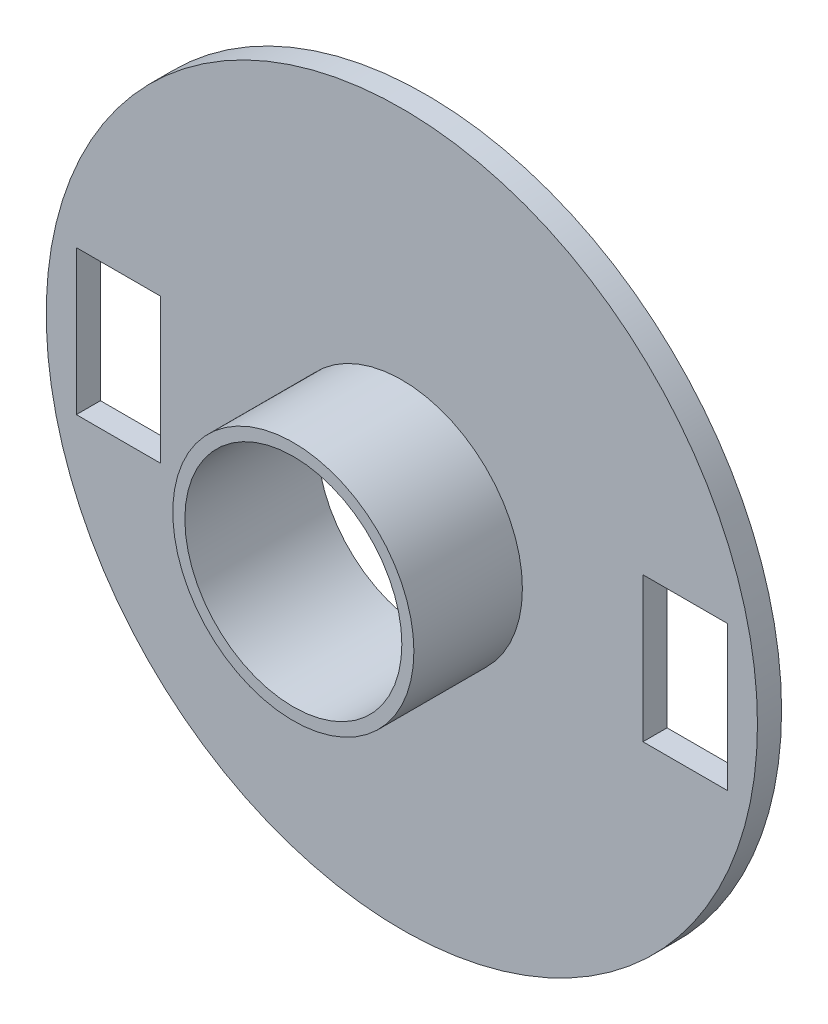
ISO-10303-21;
HEADER;
FILE_DESCRIPTION(('STEP AP214'),'2;1');
FILE_NAME('part.step','',(''),(''),'','','');
FILE_SCHEMA(('AUTOMOTIVE_DESIGN { 1 0 10303 214 1 1 1 1 }'));
ENDSEC;
DATA;
#1=APPLICATION_CONTEXT('core data for automotive mechanical design processes');
#2=APPLICATION_PROTOCOL_DEFINITION('international standard','automotive_design',2000,#1);
#3=PRODUCT_CONTEXT('',#1,'mechanical');
#4=PRODUCT('Part','Part','',(#3));
#5=PRODUCT_RELATED_PRODUCT_CATEGORY('part','',(#4));
#6=PRODUCT_DEFINITION_FORMATION('','',#4);
#7=PRODUCT_DEFINITION_CONTEXT('part definition',#1,'design');
#8=PRODUCT_DEFINITION('design','',#6,#7);
#9=PRODUCT_DEFINITION_SHAPE('','',#8);
#10=(LENGTH_UNIT() NAMED_UNIT(*) SI_UNIT(.MILLI.,.METRE.));
#11=(NAMED_UNIT(*) PLANE_ANGLE_UNIT() SI_UNIT($,.RADIAN.));
#12=(NAMED_UNIT(*) SI_UNIT($,.STERADIAN.) SOLID_ANGLE_UNIT());
#13=UNCERTAINTY_MEASURE_WITH_UNIT(LENGTH_MEASURE(1.E-05),#10,'distance_accuracy_value','');
#14=(GEOMETRIC_REPRESENTATION_CONTEXT(3) GLOBAL_UNCERTAINTY_ASSIGNED_CONTEXT((#13)) GLOBAL_UNIT_ASSIGNED_CONTEXT((#10,
#11,#12)) REPRESENTATION_CONTEXT('',''));
#15=CARTESIAN_POINT('',(0.,0.,0.));
#16=DIRECTION('',(0.,0.,1.));
#17=DIRECTION('',(1.,0.,0.));
#18=AXIS2_PLACEMENT_3D('',#15,#16,#17);
#19=CARTESIAN_POINT('',(0.,0.,1.));
#20=DIRECTION('',(0.,0.,-1.));
#21=DIRECTION('',(-1.,0.,0.));
#22=AXIS2_PLACEMENT_3D('',#19,#20,#21);
#23=CYLINDRICAL_SURFACE('',#22,14.75);
#24=CARTESIAN_POINT('',(0.,0.,1.));
#25=DIRECTION('',(0.,0.,1.));
#26=DIRECTION('',(1.,0.,0.));
#27=AXIS2_PLACEMENT_3D('',#24,#25,#26);
#28=CIRCLE('',#27,14.75);
#29=CARTESIAN_POINT('',(14.75,0.,1.));
#30=VERTEX_POINT('',#29);
#31=EDGE_CURVE('E47',#30,#30,#28,.T.);
#32=ORIENTED_EDGE('',*,*,#31,.F.);
#33=EDGE_LOOP('',(#32));
#34=FACE_BOUND('',#33,.T.);
#35=CARTESIAN_POINT('',(0.,0.,0.));
#36=DIRECTION('',(0.,0.,1.));
#37=DIRECTION('',(1.,0.,0.));
#38=AXIS2_PLACEMENT_3D('',#35,#36,#37);
#39=CIRCLE('',#38,14.75);
#40=CARTESIAN_POINT('',(14.75,0.,0.));
#41=VERTEX_POINT('',#40);
#42=EDGE_CURVE('E42',#41,#41,#39,.T.);
#43=ORIENTED_EDGE('',*,*,#42,.T.);
#44=EDGE_LOOP('',(#43));
#45=FACE_BOUND('',#44,.T.);
#46=ADVANCED_FACE('F39',(#34,#45),#23,.T.);
#47=CARTESIAN_POINT('',(0.,0.,1.));
#48=DIRECTION('',(0.,0.,1.));
#49=DIRECTION('',(1.,0.,0.));
#50=AXIS2_PLACEMENT_3D('',#47,#48,#49);
#51=PLANE('',#50);
#52=DIRECTION('',(-1.,0.,0.));
#53=VECTOR('',#52,1.);
#54=CARTESIAN_POINT('',(0.,3.,1.));
#55=LINE('',#54,#53);
#56=CARTESIAN_POINT('',(13.5,3.,1.));
#57=VERTEX_POINT('',#56);
#58=CARTESIAN_POINT('',(10.,3.,1.));
#59=VERTEX_POINT('',#58);
#60=EDGE_CURVE('E178',#57,#59,#55,.T.);
#61=ORIENTED_EDGE('',*,*,#60,.F.);
#62=DIRECTION('',(0.,1.,0.));
#63=VECTOR('',#62,1.);
#64=CARTESIAN_POINT('',(13.5,0.,1.));
#65=LINE('',#64,#63);
#66=CARTESIAN_POINT('',(13.5,-3.,1.));
#67=VERTEX_POINT('',#66);
#68=EDGE_CURVE('E176',#67,#57,#65,.T.);
#69=ORIENTED_EDGE('',*,*,#68,.F.);
#70=DIRECTION('',(1.,0.,0.));
#71=VECTOR('',#70,1.);
#72=CARTESIAN_POINT('',(0.,-3.00000000000001,1.));
#73=LINE('',#72,#71);
#74=CARTESIAN_POINT('',(10.,-3.,1.));
#75=VERTEX_POINT('',#74);
#76=EDGE_CURVE('E174',#75,#67,#73,.T.);
#77=ORIENTED_EDGE('',*,*,#76,.F.);
#78=DIRECTION('',(0.,-1.,0.));
#79=VECTOR('',#78,1.);
#80=CARTESIAN_POINT('',(10.,0.,1.));
#81=LINE('',#80,#79);
#82=EDGE_CURVE('E172',#59,#75,#81,.T.);
#83=ORIENTED_EDGE('',*,*,#82,.F.);
#84=EDGE_LOOP('',(#61,#69,#77,#83));
#85=FACE_BOUND('',#84,.T.);
#86=DIRECTION('',(0.,-1.,0.));
#87=VECTOR('',#86,1.);
#88=CARTESIAN_POINT('',(-13.5,0.,1.));
#89=LINE('',#88,#87);
#90=CARTESIAN_POINT('',(-13.5,2.99999999999999,1.));
#91=VERTEX_POINT('',#90);
#92=CARTESIAN_POINT('',(-13.5,-3.00000000000001,1.));
#93=VERTEX_POINT('',#92);
#94=EDGE_CURVE('E110',#91,#93,#89,.T.);
#95=ORIENTED_EDGE('',*,*,#94,.F.);
#96=DIRECTION('',(-1.,0.,0.));
#97=VECTOR('',#96,1.);
#98=CARTESIAN_POINT('',(0.,3.,1.));
#99=LINE('',#98,#97);
#100=CARTESIAN_POINT('',(-10.,3.,1.));
#101=VERTEX_POINT('',#100);
#102=EDGE_CURVE('E169',#101,#91,#99,.T.);
#103=ORIENTED_EDGE('',*,*,#102,.F.);
#104=DIRECTION('',(0.,1.,0.));
#105=VECTOR('',#104,1.);
#106=CARTESIAN_POINT('',(-10.,0.,1.));
#107=LINE('',#106,#105);
#108=CARTESIAN_POINT('',(-10.,-3.00000000000001,1.));
#109=VERTEX_POINT('',#108);
#110=EDGE_CURVE('E167',#109,#101,#107,.T.);
#111=ORIENTED_EDGE('',*,*,#110,.F.);
#112=DIRECTION('',(1.,0.,0.));
#113=VECTOR('',#112,1.);
#114=CARTESIAN_POINT('',(0.,-3.00000000000001,1.));
#115=LINE('',#114,#113);
#116=EDGE_CURVE('E163',#93,#109,#115,.T.);
#117=ORIENTED_EDGE('',*,*,#116,.F.);
#118=EDGE_LOOP('',(#95,#103,#111,#117));
#119=FACE_BOUND('',#118,.T.);
#120=CARTESIAN_POINT('',(0.,0.,1.));
#121=DIRECTION('',(0.,0.,1.));
#122=DIRECTION('',(1.,0.,0.));
#123=AXIS2_PLACEMENT_3D('',#120,#121,#122);
#124=CIRCLE('',#123,5.);
#125=CARTESIAN_POINT('',(5.,0.,1.));
#126=VERTEX_POINT('',#125);
#127=EDGE_CURVE('E11',#126,#126,#124,.T.);
#128=ORIENTED_EDGE('',*,*,#127,.F.);
#129=EDGE_LOOP('',(#128));
#130=FACE_BOUND('',#129,.T.);
#131=ORIENTED_EDGE('',*,*,#31,.T.);
#132=EDGE_LOOP('',(#131));
#133=FACE_BOUND('',#132,.T.);
#134=ADVANCED_FACE('F191',(#85,#119,#130,#133),#51,.T.);
#135=CARTESIAN_POINT('',(0.,0.,0.));
#136=DIRECTION('',(0.,0.,1.));
#137=DIRECTION('',(1.,0.,0.));
#138=AXIS2_PLACEMENT_3D('',#135,#136,#137);
#139=PLANE('',#138);
#140=DIRECTION('',(0.,1.,0.));
#141=VECTOR('',#140,1.);
#142=CARTESIAN_POINT('',(13.5,3.,0.));
#143=LINE('',#142,#141);
#144=CARTESIAN_POINT('',(13.5,-3.,0.));
#145=VERTEX_POINT('',#144);
#146=CARTESIAN_POINT('',(13.5,3.,0.));
#147=VERTEX_POINT('',#146);
#148=EDGE_CURVE('E151',#145,#147,#143,.T.);
#149=ORIENTED_EDGE('',*,*,#148,.T.);
#150=DIRECTION('',(-1.,0.,0.));
#151=VECTOR('',#150,1.);
#152=CARTESIAN_POINT('',(10.,3.,0.));
#153=LINE('',#152,#151);
#154=CARTESIAN_POINT('',(10.,3.,0.));
#155=VERTEX_POINT('',#154);
#156=EDGE_CURVE('E142',#147,#155,#153,.T.);
#157=ORIENTED_EDGE('',*,*,#156,.T.);
#158=DIRECTION('',(0.,-1.,0.));
#159=VECTOR('',#158,1.);
#160=CARTESIAN_POINT('',(10.,3.,0.));
#161=LINE('',#160,#159);
#162=CARTESIAN_POINT('',(10.,-3.,0.));
#163=VERTEX_POINT('',#162);
#164=EDGE_CURVE('E145',#155,#163,#161,.T.);
#165=ORIENTED_EDGE('',*,*,#164,.T.);
#166=DIRECTION('',(1.,0.,0.));
#167=VECTOR('',#166,1.);
#168=CARTESIAN_POINT('',(10.,-3.,0.));
#169=LINE('',#168,#167);
#170=EDGE_CURVE('E148',#163,#145,#169,.T.);
#171=ORIENTED_EDGE('',*,*,#170,.T.);
#172=EDGE_LOOP('',(#149,#157,#165,#171));
#173=FACE_BOUND('',#172,.T.);
#174=DIRECTION('',(-1.,0.,0.));
#175=VECTOR('',#174,1.);
#176=CARTESIAN_POINT('',(-10.,3.,0.));
#177=LINE('',#176,#175);
#178=CARTESIAN_POINT('',(-10.,3.,0.));
#179=VERTEX_POINT('',#178);
#180=CARTESIAN_POINT('',(-13.5,2.99999999999999,0.));
#181=VERTEX_POINT('',#180);
#182=EDGE_CURVE('E113',#179,#181,#177,.T.);
#183=ORIENTED_EDGE('',*,*,#182,.T.);
#184=DIRECTION('',(0.,-1.,0.));
#185=VECTOR('',#184,1.);
#186=CARTESIAN_POINT('',(-13.5,2.99999999999999,0.));
#187=LINE('',#186,#185);
#188=CARTESIAN_POINT('',(-13.5,-3.00000000000001,0.));
#189=VERTEX_POINT('',#188);
#190=EDGE_CURVE('E107',#181,#189,#187,.T.);
#191=ORIENTED_EDGE('',*,*,#190,.T.);
#192=DIRECTION('',(1.,0.,0.));
#193=VECTOR('',#192,1.);
#194=CARTESIAN_POINT('',(-10.,-3.00000000000001,0.));
#195=LINE('',#194,#193);
#196=CARTESIAN_POINT('',(-10.,-3.00000000000001,0.));
#197=VERTEX_POINT('',#196);
#198=EDGE_CURVE('E117',#189,#197,#195,.T.);
#199=ORIENTED_EDGE('',*,*,#198,.T.);
#200=DIRECTION('',(0.,1.,0.));
#201=VECTOR('',#200,1.);
#202=CARTESIAN_POINT('',(-10.,3.,0.));
#203=LINE('',#202,#201);
#204=EDGE_CURVE('E122',#197,#179,#203,.T.);
#205=ORIENTED_EDGE('',*,*,#204,.T.);
#206=EDGE_LOOP('',(#183,#191,#199,#205));
#207=FACE_BOUND('',#206,.T.);
#208=CARTESIAN_POINT('',(0.,0.,0.));
#209=DIRECTION('',(0.,0.,1.));
#210=DIRECTION('',(1.,0.,0.));
#211=AXIS2_PLACEMENT_3D('',#208,#209,#210);
#212=CIRCLE('',#211,4.5);
#213=CARTESIAN_POINT('',(4.5,0.,0.));
#214=VERTEX_POINT('',#213);
#215=EDGE_CURVE('E160',#214,#214,#212,.T.);
#216=ORIENTED_EDGE('',*,*,#215,.T.);
#217=EDGE_LOOP('',(#216));
#218=FACE_BOUND('',#217,.T.);
#219=ORIENTED_EDGE('',*,*,#42,.F.);
#220=EDGE_LOOP('',(#219));
#221=FACE_BOUND('',#220,.T.);
#222=ADVANCED_FACE('F124',(#173,#207,#218,#221),#139,.F.);
#223=CARTESIAN_POINT('',(0.,0.,5.5));
#224=DIRECTION('',(0.,0.,-1.));
#225=DIRECTION('',(-1.,0.,0.));
#226=AXIS2_PLACEMENT_3D('',#223,#224,#225);
#227=CYLINDRICAL_SURFACE('',#226,5.);
#228=CARTESIAN_POINT('',(0.,0.,5.5));
#229=DIRECTION('',(0.,0.,1.));
#230=DIRECTION('',(1.,0.,0.));
#231=AXIS2_PLACEMENT_3D('',#228,#229,#230);
#232=CIRCLE('',#231,5.);
#233=CARTESIAN_POINT('',(5.,0.,5.5));
#234=VERTEX_POINT('',#233);
#235=EDGE_CURVE('E180',#234,#234,#232,.T.);
#236=ORIENTED_EDGE('',*,*,#235,.F.);
#237=EDGE_LOOP('',(#236));
#238=FACE_BOUND('',#237,.T.);
#239=ORIENTED_EDGE('',*,*,#127,.T.);
#240=EDGE_LOOP('',(#239));
#241=FACE_BOUND('',#240,.T.);
#242=ADVANCED_FACE('F190',(#238,#241),#227,.T.);
#243=CARTESIAN_POINT('',(0.,0.,5.5));
#244=DIRECTION('',(0.,0.,1.));
#245=DIRECTION('',(1.,0.,0.));
#246=AXIS2_PLACEMENT_3D('',#243,#244,#245);
#247=PLANE('',#246);
#248=CARTESIAN_POINT('',(0.,0.,5.5));
#249=DIRECTION('',(0.,0.,1.));
#250=DIRECTION('',(1.,0.,0.));
#251=AXIS2_PLACEMENT_3D('',#248,#249,#250);
#252=CIRCLE('',#251,4.5);
#253=CARTESIAN_POINT('',(4.5,0.,5.5));
#254=VERTEX_POINT('',#253);
#255=EDGE_CURVE('E137',#254,#254,#252,.T.);
#256=ORIENTED_EDGE('',*,*,#255,.F.);
#257=EDGE_LOOP('',(#256));
#258=FACE_BOUND('',#257,.T.);
#259=ORIENTED_EDGE('',*,*,#235,.T.);
#260=EDGE_LOOP('',(#259));
#261=FACE_BOUND('',#260,.T.);
#262=ADVANCED_FACE('F198',(#258,#261),#247,.T.);
#263=CARTESIAN_POINT('',(0.,0.,0.));
#264=DIRECTION('',(0.,0.,1.));
#265=DIRECTION('',(1.,0.,0.));
#266=AXIS2_PLACEMENT_3D('',#263,#264,#265);
#267=CYLINDRICAL_SURFACE('',#266,4.5);
#268=ORIENTED_EDGE('',*,*,#215,.F.);
#269=EDGE_LOOP('',(#268));
#270=FACE_BOUND('',#269,.T.);
#271=ORIENTED_EDGE('',*,*,#255,.T.);
#272=EDGE_LOOP('',(#271));
#273=FACE_BOUND('',#272,.T.);
#274=ADVANCED_FACE('F223',(#270,#273),#267,.F.);
#275=CARTESIAN_POINT('',(-13.5,2.99999999999999,0.));
#276=DIRECTION('',(-1.,0.,0.));
#277=DIRECTION('',(0.,0.,1.));
#278=AXIS2_PLACEMENT_3D('',#275,#276,#277);
#279=PLANE('',#278);
#280=ORIENTED_EDGE('',*,*,#94,.T.);
#281=DIRECTION('',(0.,0.,1.));
#282=VECTOR('',#281,1.);
#283=CARTESIAN_POINT('',(-13.5,-3.00000000000001,0.));
#284=LINE('',#283,#282);
#285=EDGE_CURVE('E63',#189,#93,#284,.T.);
#286=ORIENTED_EDGE('',*,*,#285,.F.);
#287=ORIENTED_EDGE('',*,*,#190,.F.);
#288=DIRECTION('',(0.,0.,1.));
#289=VECTOR('',#288,1.);
#290=CARTESIAN_POINT('',(-13.5,2.99999999999999,0.));
#291=LINE('',#290,#289);
#292=EDGE_CURVE('E135',#181,#91,#291,.T.);
#293=ORIENTED_EDGE('',*,*,#292,.T.);
#294=EDGE_LOOP('',(#280,#286,#287,#293));
#295=FACE_BOUND('',#294,.T.);
#296=ADVANCED_FACE('F104',(#295),#279,.F.);
#297=CARTESIAN_POINT('',(-10.,3.,0.));
#298=DIRECTION('',(0.,1.,0.));
#299=DIRECTION('',(-1.,0.,0.));
#300=AXIS2_PLACEMENT_3D('',#297,#298,#299);
#301=PLANE('',#300);
#302=ORIENTED_EDGE('',*,*,#102,.T.);
#303=ORIENTED_EDGE('',*,*,#292,.F.);
#304=ORIENTED_EDGE('',*,*,#182,.F.);
#305=DIRECTION('',(0.,0.,1.));
#306=VECTOR('',#305,1.);
#307=CARTESIAN_POINT('',(-10.,3.,0.));
#308=LINE('',#307,#306);
#309=EDGE_CURVE('E138',#179,#101,#308,.T.);
#310=ORIENTED_EDGE('',*,*,#309,.T.);
#311=EDGE_LOOP('',(#302,#303,#304,#310));
#312=FACE_BOUND('',#311,.T.);
#313=ADVANCED_FACE('F238',(#312),#301,.F.);
#314=CARTESIAN_POINT('',(-10.,3.,0.));
#315=DIRECTION('',(1.,0.,0.));
#316=DIRECTION('',(0.,1.,0.));
#317=AXIS2_PLACEMENT_3D('',#314,#315,#316);
#318=PLANE('',#317);
#319=ORIENTED_EDGE('',*,*,#110,.T.);
#320=ORIENTED_EDGE('',*,*,#309,.F.);
#321=ORIENTED_EDGE('',*,*,#204,.F.);
#322=DIRECTION('',(0.,0.,1.));
#323=VECTOR('',#322,1.);
#324=CARTESIAN_POINT('',(-10.,-3.00000000000001,0.));
#325=LINE('',#324,#323);
#326=EDGE_CURVE('E112',#197,#109,#325,.T.);
#327=ORIENTED_EDGE('',*,*,#326,.T.);
#328=EDGE_LOOP('',(#319,#320,#321,#327));
#329=FACE_BOUND('',#328,.T.);
#330=ADVANCED_FACE('F245',(#329),#318,.F.);
#331=CARTESIAN_POINT('',(-10.,-3.00000000000001,0.));
#332=DIRECTION('',(0.,-1.,0.));
#333=DIRECTION('',(0.,0.,-1.));
#334=AXIS2_PLACEMENT_3D('',#331,#332,#333);
#335=PLANE('',#334);
#336=ORIENTED_EDGE('',*,*,#116,.T.);
#337=ORIENTED_EDGE('',*,*,#326,.F.);
#338=ORIENTED_EDGE('',*,*,#198,.F.);
#339=ORIENTED_EDGE('',*,*,#285,.T.);
#340=EDGE_LOOP('',(#336,#337,#338,#339));
#341=FACE_BOUND('',#340,.T.);
#342=ADVANCED_FACE('F118',(#341),#335,.F.);
#343=CARTESIAN_POINT('',(10.,3.,0.));
#344=DIRECTION('',(0.,1.,0.));
#345=DIRECTION('',(-1.,0.,0.));
#346=AXIS2_PLACEMENT_3D('',#343,#344,#345);
#347=PLANE('',#346);
#348=ORIENTED_EDGE('',*,*,#60,.T.);
#349=DIRECTION('',(0.,0.,1.));
#350=VECTOR('',#349,1.);
#351=CARTESIAN_POINT('',(10.,3.,0.));
#352=LINE('',#351,#350);
#353=EDGE_CURVE('E55',#155,#59,#352,.T.);
#354=ORIENTED_EDGE('',*,*,#353,.F.);
#355=ORIENTED_EDGE('',*,*,#156,.F.);
#356=DIRECTION('',(0.,0.,1.));
#357=VECTOR('',#356,1.);
#358=CARTESIAN_POINT('',(13.5,3.,0.));
#359=LINE('',#358,#357);
#360=EDGE_CURVE('E127',#147,#57,#359,.T.);
#361=ORIENTED_EDGE('',*,*,#360,.T.);
#362=EDGE_LOOP('',(#348,#354,#355,#361));
#363=FACE_BOUND('',#362,.T.);
#364=ADVANCED_FACE('F260',(#363),#347,.F.);
#365=CARTESIAN_POINT('',(13.5,3.,0.));
#366=DIRECTION('',(1.,0.,0.));
#367=DIRECTION('',(0.,0.,-1.));
#368=AXIS2_PLACEMENT_3D('',#365,#366,#367);
#369=PLANE('',#368);
#370=ORIENTED_EDGE('',*,*,#68,.T.);
#371=ORIENTED_EDGE('',*,*,#360,.F.);
#372=ORIENTED_EDGE('',*,*,#148,.F.);
#373=DIRECTION('',(0.,0.,1.));
#374=VECTOR('',#373,1.);
#375=CARTESIAN_POINT('',(13.5,-3.,0.));
#376=LINE('',#375,#374);
#377=EDGE_CURVE('E130',#145,#67,#376,.T.);
#378=ORIENTED_EDGE('',*,*,#377,.T.);
#379=EDGE_LOOP('',(#370,#371,#372,#378));
#380=FACE_BOUND('',#379,.T.);
#381=ADVANCED_FACE('F267',(#380),#369,.F.);
#382=CARTESIAN_POINT('',(10.,-3.,0.));
#383=DIRECTION('',(0.,-1.,0.));
#384=DIRECTION('',(1.,0.,0.));
#385=AXIS2_PLACEMENT_3D('',#382,#383,#384);
#386=PLANE('',#385);
#387=ORIENTED_EDGE('',*,*,#76,.T.);
#388=ORIENTED_EDGE('',*,*,#377,.F.);
#389=ORIENTED_EDGE('',*,*,#170,.F.);
#390=DIRECTION('',(0.,0.,1.));
#391=VECTOR('',#390,1.);
#392=CARTESIAN_POINT('',(10.,-3.,0.));
#393=LINE('',#392,#391);
#394=EDGE_CURVE('E156',#163,#75,#393,.T.);
#395=ORIENTED_EDGE('',*,*,#394,.T.);
#396=EDGE_LOOP('',(#387,#388,#389,#395));
#397=FACE_BOUND('',#396,.T.);
#398=ADVANCED_FACE('F275',(#397),#386,.F.);
#399=CARTESIAN_POINT('',(10.,3.,0.));
#400=DIRECTION('',(-1.,0.,0.));
#401=DIRECTION('',(0.,-1.,0.));
#402=AXIS2_PLACEMENT_3D('',#399,#400,#401);
#403=PLANE('',#402);
#404=ORIENTED_EDGE('',*,*,#82,.T.);
#405=ORIENTED_EDGE('',*,*,#394,.F.);
#406=ORIENTED_EDGE('',*,*,#164,.F.);
#407=ORIENTED_EDGE('',*,*,#353,.T.);
#408=EDGE_LOOP('',(#404,#405,#406,#407));
#409=FACE_BOUND('',#408,.T.);
#410=ADVANCED_FACE('F283',(#409),#403,.F.);
#411=CLOSED_SHELL('',(#46,#134,#222,#242,#262,#274,#296,#313,#330,#342,#364,#381,#398,#410));
#412=MANIFOLD_SOLID_BREP('B2',#411);
#413=ADVANCED_BREP_SHAPE_REPRESENTATION('',(#18,#412),#14);
#414=SHAPE_DEFINITION_REPRESENTATION(#9,#413);
ENDSEC;
END-ISO-10303-21;
